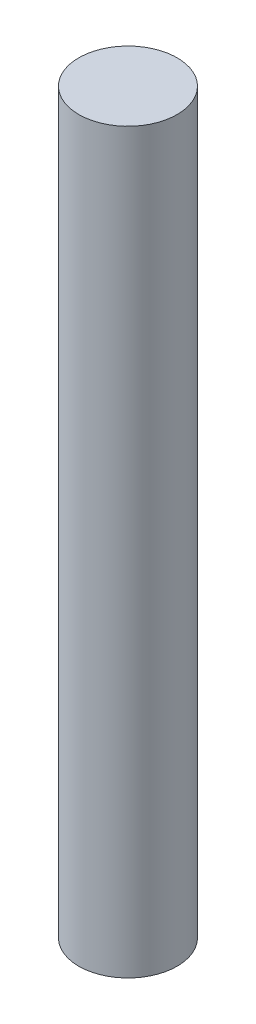
ISO-10303-21;
HEADER;
FILE_DESCRIPTION(('STEP AP214'),'2;1');
FILE_NAME('part.step','',(''),(''),'','','');
FILE_SCHEMA(('AUTOMOTIVE_DESIGN { 1 0 10303 214 1 1 1 1 }'));
ENDSEC;
DATA;
#1=APPLICATION_CONTEXT('core data for automotive mechanical design processes');
#2=APPLICATION_PROTOCOL_DEFINITION('international standard','automotive_design',2000,#1);
#3=PRODUCT_CONTEXT('',#1,'mechanical');
#4=PRODUCT('Part','Part','',(#3));
#5=PRODUCT_RELATED_PRODUCT_CATEGORY('part','',(#4));
#6=PRODUCT_DEFINITION_FORMATION('','',#4);
#7=PRODUCT_DEFINITION_CONTEXT('part definition',#1,'design');
#8=PRODUCT_DEFINITION('design','',#6,#7);
#9=PRODUCT_DEFINITION_SHAPE('','',#8);
#10=(LENGTH_UNIT() NAMED_UNIT(*) SI_UNIT(.MILLI.,.METRE.));
#11=(NAMED_UNIT(*) PLANE_ANGLE_UNIT() SI_UNIT($,.RADIAN.));
#12=(NAMED_UNIT(*) SI_UNIT($,.STERADIAN.) SOLID_ANGLE_UNIT());
#13=UNCERTAINTY_MEASURE_WITH_UNIT(LENGTH_MEASURE(1.E-05),#10,'distance_accuracy_value','');
#14=(GEOMETRIC_REPRESENTATION_CONTEXT(3) GLOBAL_UNCERTAINTY_ASSIGNED_CONTEXT((#13)) GLOBAL_UNIT_ASSIGNED_CONTEXT((#10,
#11,#12)) REPRESENTATION_CONTEXT('',''));
#15=CARTESIAN_POINT('',(0.,0.,0.));
#16=DIRECTION('',(0.,0.,1.));
#17=DIRECTION('',(1.,0.,0.));
#18=AXIS2_PLACEMENT_3D('',#15,#16,#17);
#19=CARTESIAN_POINT('',(0.,37.5,0.));
#20=DIRECTION('',(0.,-1.,0.));
#21=DIRECTION('',(0.,0.,-1.));
#22=AXIS2_PLACEMENT_3D('',#19,#20,#21);
#23=CYLINDRICAL_SURFACE('',#22,5.);
#24=CARTESIAN_POINT('',(0.,37.5,0.));
#25=DIRECTION('',(0.,1.,0.));
#26=DIRECTION('',(0.,0.,1.));
#27=AXIS2_PLACEMENT_3D('',#24,#25,#26);
#28=CIRCLE('',#27,5.);
#29=CARTESIAN_POINT('',(0.,37.5,5.));
#30=VERTEX_POINT('',#29);
#31=EDGE_CURVE('E10',#30,#30,#28,.T.);
#32=ORIENTED_EDGE('',*,*,#31,.F.);
#33=EDGE_LOOP('',(#32));
#34=FACE_BOUND('',#33,.T.);
#35=CARTESIAN_POINT('',(0.,-37.5,0.));
#36=DIRECTION('',(0.,1.,0.));
#37=DIRECTION('',(0.,0.,1.));
#38=AXIS2_PLACEMENT_3D('',#35,#36,#37);
#39=CIRCLE('',#38,5.);
#40=CARTESIAN_POINT('',(0.,-37.5,5.));
#41=VERTEX_POINT('',#40);
#42=EDGE_CURVE('E34',#41,#41,#39,.T.);
#43=ORIENTED_EDGE('',*,*,#42,.T.);
#44=EDGE_LOOP('',(#43));
#45=FACE_BOUND('',#44,.T.);
#46=ADVANCED_FACE('F31',(#34,#45),#23,.T.);
#47=CARTESIAN_POINT('',(0.,37.5,0.));
#48=DIRECTION('',(0.,1.,0.));
#49=DIRECTION('',(0.,0.,1.));
#50=AXIS2_PLACEMENT_3D('',#47,#48,#49);
#51=PLANE('',#50);
#52=ORIENTED_EDGE('',*,*,#31,.T.);
#53=EDGE_LOOP('',(#52));
#54=FACE_BOUND('',#53,.T.);
#55=ADVANCED_FACE('F46',(#54),#51,.T.);
#56=CARTESIAN_POINT('',(0.,-37.5,0.));
#57=DIRECTION('',(0.,1.,0.));
#58=DIRECTION('',(0.,0.,1.));
#59=AXIS2_PLACEMENT_3D('',#56,#57,#58);
#60=PLANE('',#59);
#61=ORIENTED_EDGE('',*,*,#42,.F.);
#62=EDGE_LOOP('',(#61));
#63=FACE_BOUND('',#62,.T.);
#64=ADVANCED_FACE('F44',(#63),#60,.F.);
#65=CLOSED_SHELL('',(#46,#55,#64));
#66=MANIFOLD_SOLID_BREP('B2',#65);
#67=ADVANCED_BREP_SHAPE_REPRESENTATION('',(#18,#66),#14);
#68=SHAPE_DEFINITION_REPRESENTATION(#9,#67);
ENDSEC;
END-ISO-10303-21;
